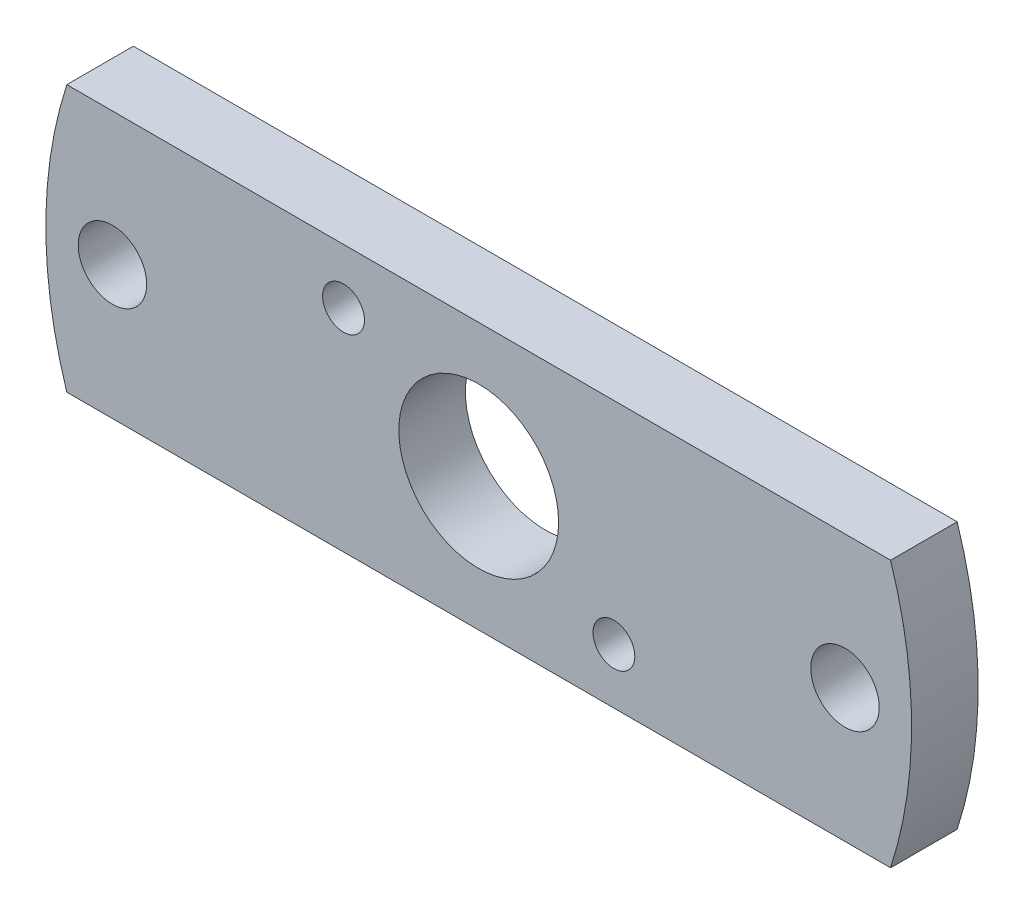
ISO-10303-21;
HEADER;
FILE_DESCRIPTION(('STEP AP214'),'2;1');
FILE_NAME('part.step','',(''),(''),'','','');
FILE_SCHEMA(('AUTOMOTIVE_DESIGN { 1 0 10303 214 1 1 1 1 }'));
ENDSEC;
DATA;
#1=APPLICATION_CONTEXT('core data for automotive mechanical design processes');
#2=APPLICATION_PROTOCOL_DEFINITION('international standard','automotive_design',2000,#1);
#3=PRODUCT_CONTEXT('',#1,'mechanical');
#4=PRODUCT('Part','Part','',(#3));
#5=PRODUCT_RELATED_PRODUCT_CATEGORY('part','',(#4));
#6=PRODUCT_DEFINITION_FORMATION('','',#4);
#7=PRODUCT_DEFINITION_CONTEXT('part definition',#1,'design');
#8=PRODUCT_DEFINITION('design','',#6,#7);
#9=PRODUCT_DEFINITION_SHAPE('','',#8);
#10=(LENGTH_UNIT() NAMED_UNIT(*) SI_UNIT(.MILLI.,.METRE.));
#11=(NAMED_UNIT(*) PLANE_ANGLE_UNIT() SI_UNIT($,.RADIAN.));
#12=(NAMED_UNIT(*) SI_UNIT($,.STERADIAN.) SOLID_ANGLE_UNIT());
#13=UNCERTAINTY_MEASURE_WITH_UNIT(LENGTH_MEASURE(1.E-05),#10,'distance_accuracy_value','');
#14=(GEOMETRIC_REPRESENTATION_CONTEXT(3) GLOBAL_UNCERTAINTY_ASSIGNED_CONTEXT((#13)) GLOBAL_UNIT_ASSIGNED_CONTEXT((#10,
#11,#12)) REPRESENTATION_CONTEXT('',''));
#15=CARTESIAN_POINT('',(0.,0.,0.));
#16=DIRECTION('',(0.,0.,1.));
#17=DIRECTION('',(1.,0.,0.));
#18=AXIS2_PLACEMENT_3D('',#15,#16,#17);
#19=CARTESIAN_POINT('',(0.,0.,3.175));
#20=DIRECTION('',(0.,0.,1.));
#21=DIRECTION('',(1.,0.,0.));
#22=AXIS2_PLACEMENT_3D('',#19,#20,#21);
#23=PLANE('',#22);
#24=CARTESIAN_POINT('',(-6.44513426004359,3.72110000000166,3.175));
#25=DIRECTION('',(0.,0.,1.));
#26=DIRECTION('',(1.,0.,0.));
#27=AXIS2_PLACEMENT_3D('',#24,#25,#26);
#28=CIRCLE('',#27,0.996949999999999);
#29=CARTESIAN_POINT('',(-5.44818426004359,3.72110000000166,3.175));
#30=VERTEX_POINT('',#29);
#31=EDGE_CURVE('E142',#30,#30,#28,.T.);
#32=ORIENTED_EDGE('',*,*,#31,.F.);
#33=EDGE_LOOP('',(#32));
#34=FACE_BOUND('',#33,.T.);
#35=CARTESIAN_POINT('',(6.44513426004548,-3.72109999999839,3.175));
#36=DIRECTION('',(0.,0.,1.));
#37=DIRECTION('',(1.,0.,0.));
#38=AXIS2_PLACEMENT_3D('',#35,#36,#37);
#39=CIRCLE('',#38,0.996949999999999);
#40=CARTESIAN_POINT('',(7.44208426004548,-3.72109999999839,3.175));
#41=VERTEX_POINT('',#40);
#42=EDGE_CURVE('E136',#41,#41,#39,.T.);
#43=ORIENTED_EDGE('',*,*,#42,.F.);
#44=EDGE_LOOP('',(#43));
#45=FACE_BOUND('',#44,.T.);
#46=CARTESIAN_POINT('',(-17.4625,0.,3.175));
#47=DIRECTION('',(0.,0.,1.));
#48=DIRECTION('',(1.,0.,0.));
#49=AXIS2_PLACEMENT_3D('',#46,#47,#48);
#50=CIRCLE('',#49,1.63195);
#51=CARTESIAN_POINT('',(-15.83055,0.,3.175));
#52=VERTEX_POINT('',#51);
#53=EDGE_CURVE('E130',#52,#52,#50,.T.);
#54=ORIENTED_EDGE('',*,*,#53,.F.);
#55=EDGE_LOOP('',(#54));
#56=FACE_BOUND('',#55,.T.);
#57=CARTESIAN_POINT('',(17.4625,0.,3.175));
#58=DIRECTION('',(0.,0.,1.));
#59=DIRECTION('',(1.,0.,0.));
#60=AXIS2_PLACEMENT_3D('',#57,#58,#59);
#61=CIRCLE('',#60,1.63195);
#62=CARTESIAN_POINT('',(19.09445,0.,3.175));
#63=VERTEX_POINT('',#62);
#64=EDGE_CURVE('E124',#63,#63,#61,.T.);
#65=ORIENTED_EDGE('',*,*,#64,.F.);
#66=EDGE_LOOP('',(#65));
#67=FACE_BOUND('',#66,.T.);
#68=CARTESIAN_POINT('',(0.,0.,3.175));
#69=DIRECTION('',(0.,0.,1.));
#70=DIRECTION('',(1.,0.,0.));
#71=AXIS2_PLACEMENT_3D('',#68,#69,#70);
#72=CIRCLE('',#71,20.6375);
#73=CARTESIAN_POINT('',(-19.6362905420041,6.35,3.175));
#74=VERTEX_POINT('',#73);
#75=CARTESIAN_POINT('',(-19.6362905420041,-6.35,3.175));
#76=VERTEX_POINT('',#75);
#77=EDGE_CURVE('E89',#74,#76,#72,.T.);
#78=ORIENTED_EDGE('',*,*,#77,.T.);
#79=DIRECTION('',(1.,0.,0.));
#80=VECTOR('',#79,1.);
#81=CARTESIAN_POINT('',(19.6362905420041,-6.35,3.175));
#82=LINE('',#81,#80);
#83=CARTESIAN_POINT('',(19.6362905420041,-6.35000000000002,3.175));
#84=VERTEX_POINT('',#83);
#85=EDGE_CURVE('E84',#76,#84,#82,.T.);
#86=ORIENTED_EDGE('',*,*,#85,.T.);
#87=CARTESIAN_POINT('',(0.,0.,3.175));
#88=DIRECTION('',(0.,0.,1.));
#89=DIRECTION('',(1.,0.,0.));
#90=AXIS2_PLACEMENT_3D('',#87,#88,#89);
#91=CIRCLE('',#90,20.6375);
#92=CARTESIAN_POINT('',(19.6362905420041,6.35,3.175));
#93=VERTEX_POINT('',#92);
#94=EDGE_CURVE('E87',#84,#93,#91,.T.);
#95=ORIENTED_EDGE('',*,*,#94,.T.);
#96=DIRECTION('',(-1.,0.,0.));
#97=VECTOR('',#96,1.);
#98=CARTESIAN_POINT('',(-19.6362905420041,6.35,3.175));
#99=LINE('',#98,#97);
#100=EDGE_CURVE('E54',#93,#74,#99,.T.);
#101=ORIENTED_EDGE('',*,*,#100,.T.);
#102=EDGE_LOOP('',(#78,#86,#95,#101));
#103=FACE_BOUND('',#102,.T.);
#104=CARTESIAN_POINT('',(0.,0.,3.175));
#105=DIRECTION('',(0.,0.,1.));
#106=DIRECTION('',(1.,0.,0.));
#107=AXIS2_PLACEMENT_3D('',#104,#105,#106);
#108=CIRCLE('',#107,3.81);
#109=CARTESIAN_POINT('',(3.81,0.,3.175));
#110=VERTEX_POINT('',#109);
#111=EDGE_CURVE('E104',#110,#110,#108,.T.);
#112=ORIENTED_EDGE('',*,*,#111,.F.);
#113=EDGE_LOOP('',(#112));
#114=FACE_BOUND('',#113,.T.);
#115=ADVANCED_FACE('F37',(#34,#45,#56,#67,#103,#114),#23,.T.);
#116=CARTESIAN_POINT('',(0.,0.,0.));
#117=DIRECTION('',(0.,0.,1.));
#118=DIRECTION('',(1.,0.,0.));
#119=AXIS2_PLACEMENT_3D('',#116,#117,#118);
#120=PLANE('',#119);
#121=CARTESIAN_POINT('',(-6.44513426004359,3.72110000000166,0.));
#122=DIRECTION('',(0.,0.,1.));
#123=DIRECTION('',(1.,0.,0.));
#124=AXIS2_PLACEMENT_3D('',#121,#122,#123);
#125=CIRCLE('',#124,0.996949999999999);
#126=CARTESIAN_POINT('',(-5.44818426004359,3.72110000000166,0.));
#127=VERTEX_POINT('',#126);
#128=EDGE_CURVE('E139',#127,#127,#125,.T.);
#129=ORIENTED_EDGE('',*,*,#128,.T.);
#130=EDGE_LOOP('',(#129));
#131=FACE_BOUND('',#130,.T.);
#132=CARTESIAN_POINT('',(6.44513426004548,-3.72109999999839,0.));
#133=DIRECTION('',(0.,0.,1.));
#134=DIRECTION('',(1.,0.,0.));
#135=AXIS2_PLACEMENT_3D('',#132,#133,#134);
#136=CIRCLE('',#135,0.996949999999999);
#137=CARTESIAN_POINT('',(7.44208426004548,-3.72109999999839,0.));
#138=VERTEX_POINT('',#137);
#139=EDGE_CURVE('E133',#138,#138,#136,.T.);
#140=ORIENTED_EDGE('',*,*,#139,.T.);
#141=EDGE_LOOP('',(#140));
#142=FACE_BOUND('',#141,.T.);
#143=CARTESIAN_POINT('',(-17.4625,0.,0.));
#144=DIRECTION('',(0.,0.,1.));
#145=DIRECTION('',(1.,0.,0.));
#146=AXIS2_PLACEMENT_3D('',#143,#144,#145);
#147=CIRCLE('',#146,1.63195);
#148=CARTESIAN_POINT('',(-15.83055,0.,0.));
#149=VERTEX_POINT('',#148);
#150=EDGE_CURVE('E127',#149,#149,#147,.T.);
#151=ORIENTED_EDGE('',*,*,#150,.T.);
#152=EDGE_LOOP('',(#151));
#153=FACE_BOUND('',#152,.T.);
#154=CARTESIAN_POINT('',(17.4625,0.,0.));
#155=DIRECTION('',(0.,0.,1.));
#156=DIRECTION('',(1.,0.,0.));
#157=AXIS2_PLACEMENT_3D('',#154,#155,#156);
#158=CIRCLE('',#157,1.63195);
#159=CARTESIAN_POINT('',(19.09445,0.,0.));
#160=VERTEX_POINT('',#159);
#161=EDGE_CURVE('E119',#160,#160,#158,.T.);
#162=ORIENTED_EDGE('',*,*,#161,.T.);
#163=EDGE_LOOP('',(#162));
#164=FACE_BOUND('',#163,.T.);
#165=CARTESIAN_POINT('',(0.,0.,0.));
#166=DIRECTION('',(0.,0.,1.));
#167=DIRECTION('',(1.,0.,0.));
#168=AXIS2_PLACEMENT_3D('',#165,#166,#167);
#169=CIRCLE('',#168,20.6375);
#170=CARTESIAN_POINT('',(-19.6362905420041,6.35,0.));
#171=VERTEX_POINT('',#170);
#172=CARTESIAN_POINT('',(-19.6362905420041,-6.35,0.));
#173=VERTEX_POINT('',#172);
#174=EDGE_CURVE('E101',#171,#173,#169,.T.);
#175=ORIENTED_EDGE('',*,*,#174,.F.);
#176=DIRECTION('',(-1.,0.,0.));
#177=VECTOR('',#176,1.);
#178=CARTESIAN_POINT('',(-19.6362905420041,6.35,0.));
#179=LINE('',#178,#177);
#180=CARTESIAN_POINT('',(19.6362905420041,6.35,0.));
#181=VERTEX_POINT('',#180);
#182=EDGE_CURVE('E77',#181,#171,#179,.T.);
#183=ORIENTED_EDGE('',*,*,#182,.F.);
#184=CARTESIAN_POINT('',(0.,0.,0.));
#185=DIRECTION('',(0.,0.,1.));
#186=DIRECTION('',(1.,0.,0.));
#187=AXIS2_PLACEMENT_3D('',#184,#185,#186);
#188=CIRCLE('',#187,20.6375);
#189=CARTESIAN_POINT('',(19.6362905420041,-6.35000000000002,0.));
#190=VERTEX_POINT('',#189);
#191=EDGE_CURVE('E71',#190,#181,#188,.T.);
#192=ORIENTED_EDGE('',*,*,#191,.F.);
#193=DIRECTION('',(1.,0.,0.));
#194=VECTOR('',#193,1.);
#195=CARTESIAN_POINT('',(19.6362905420041,-6.35,0.));
#196=LINE('',#195,#194);
#197=EDGE_CURVE('E93',#173,#190,#196,.T.);
#198=ORIENTED_EDGE('',*,*,#197,.F.);
#199=EDGE_LOOP('',(#175,#183,#192,#198));
#200=FACE_BOUND('',#199,.T.);
#201=CARTESIAN_POINT('',(0.,0.,0.));
#202=DIRECTION('',(0.,0.,1.));
#203=DIRECTION('',(1.,0.,0.));
#204=AXIS2_PLACEMENT_3D('',#201,#202,#203);
#205=CIRCLE('',#204,3.81);
#206=CARTESIAN_POINT('',(3.81,0.,0.));
#207=VERTEX_POINT('',#206);
#208=EDGE_CURVE('E116',#207,#207,#205,.T.);
#209=ORIENTED_EDGE('',*,*,#208,.T.);
#210=EDGE_LOOP('',(#209));
#211=FACE_BOUND('',#210,.T.);
#212=ADVANCED_FACE('F112',(#131,#142,#153,#164,#200,#211),#120,.F.);
#213=CARTESIAN_POINT('',(0.,0.,3.175));
#214=DIRECTION('',(0.,0.,-1.));
#215=DIRECTION('',(-1.,0.,0.));
#216=AXIS2_PLACEMENT_3D('',#213,#214,#215);
#217=CYLINDRICAL_SURFACE('',#216,20.6375);
#218=ORIENTED_EDGE('',*,*,#174,.T.);
#219=DIRECTION('',(0.,0.,-1.));
#220=VECTOR('',#219,1.);
#221=CARTESIAN_POINT('',(-19.6362905420041,-6.35,3.175));
#222=LINE('',#221,#220);
#223=EDGE_CURVE('E11',#76,#173,#222,.T.);
#224=ORIENTED_EDGE('',*,*,#223,.F.);
#225=ORIENTED_EDGE('',*,*,#77,.F.);
#226=DIRECTION('',(0.,0.,-1.));
#227=VECTOR('',#226,1.);
#228=CARTESIAN_POINT('',(-19.6362905420041,6.35,3.175));
#229=LINE('',#228,#227);
#230=EDGE_CURVE('E97',#74,#171,#229,.T.);
#231=ORIENTED_EDGE('',*,*,#230,.T.);
#232=EDGE_LOOP('',(#218,#224,#225,#231));
#233=FACE_BOUND('',#232,.T.);
#234=ADVANCED_FACE('F39',(#233),#217,.T.);
#235=CARTESIAN_POINT('',(19.6362905420041,-6.35,3.175));
#236=DIRECTION('',(0.,1.,0.));
#237=DIRECTION('',(0.,0.,1.));
#238=AXIS2_PLACEMENT_3D('',#235,#236,#237);
#239=PLANE('',#238);
#240=ORIENTED_EDGE('',*,*,#197,.T.);
#241=DIRECTION('',(0.,0.,-1.));
#242=VECTOR('',#241,1.);
#243=CARTESIAN_POINT('',(19.6362905420041,-6.35000000000002,3.175));
#244=LINE('',#243,#242);
#245=EDGE_CURVE('E46',#84,#190,#244,.T.);
#246=ORIENTED_EDGE('',*,*,#245,.F.);
#247=ORIENTED_EDGE('',*,*,#85,.F.);
#248=ORIENTED_EDGE('',*,*,#223,.T.);
#249=EDGE_LOOP('',(#240,#246,#247,#248));
#250=FACE_BOUND('',#249,.T.);
#251=ADVANCED_FACE('F92',(#250),#239,.F.);
#252=CARTESIAN_POINT('',(0.,0.,3.175));
#253=DIRECTION('',(0.,0.,-1.));
#254=DIRECTION('',(-1.,0.,0.));
#255=AXIS2_PLACEMENT_3D('',#252,#253,#254);
#256=CYLINDRICAL_SURFACE('',#255,20.6375);
#257=ORIENTED_EDGE('',*,*,#191,.T.);
#258=DIRECTION('',(0.,0.,-1.));
#259=VECTOR('',#258,1.);
#260=CARTESIAN_POINT('',(19.6362905420041,6.35,3.175));
#261=LINE('',#260,#259);
#262=EDGE_CURVE('E94',#93,#181,#261,.T.);
#263=ORIENTED_EDGE('',*,*,#262,.F.);
#264=ORIENTED_EDGE('',*,*,#94,.F.);
#265=ORIENTED_EDGE('',*,*,#245,.T.);
#266=EDGE_LOOP('',(#257,#263,#264,#265));
#267=FACE_BOUND('',#266,.T.);
#268=ADVANCED_FACE('F95',(#267),#256,.T.);
#269=CARTESIAN_POINT('',(-19.6362905420041,6.35,3.175));
#270=DIRECTION('',(0.,-1.,0.));
#271=DIRECTION('',(0.,0.,-1.));
#272=AXIS2_PLACEMENT_3D('',#269,#270,#271);
#273=PLANE('',#272);
#274=ORIENTED_EDGE('',*,*,#182,.T.);
#275=ORIENTED_EDGE('',*,*,#230,.F.);
#276=ORIENTED_EDGE('',*,*,#100,.F.);
#277=ORIENTED_EDGE('',*,*,#262,.T.);
#278=EDGE_LOOP('',(#274,#275,#276,#277));
#279=FACE_BOUND('',#278,.T.);
#280=ADVANCED_FACE('F109',(#279),#273,.F.);
#281=CARTESIAN_POINT('',(0.,0.,3.175));
#282=DIRECTION('',(0.,0.,-1.));
#283=DIRECTION('',(-1.,0.,0.));
#284=AXIS2_PLACEMENT_3D('',#281,#282,#283);
#285=CYLINDRICAL_SURFACE('',#284,3.81);
#286=ORIENTED_EDGE('',*,*,#111,.T.);
#287=EDGE_LOOP('',(#286));
#288=FACE_BOUND('',#287,.T.);
#289=ORIENTED_EDGE('',*,*,#208,.F.);
#290=EDGE_LOOP('',(#289));
#291=FACE_BOUND('',#290,.T.);
#292=ADVANCED_FACE('F160',(#288,#291),#285,.F.);
#293=CARTESIAN_POINT('',(17.4625,0.,3.175));
#294=DIRECTION('',(0.,0.,1.));
#295=DIRECTION('',(1.,0.,0.));
#296=AXIS2_PLACEMENT_3D('',#293,#294,#295);
#297=CYLINDRICAL_SURFACE('',#296,1.63195);
#298=ORIENTED_EDGE('',*,*,#161,.F.);
#299=EDGE_LOOP('',(#298));
#300=FACE_BOUND('',#299,.T.);
#301=ORIENTED_EDGE('',*,*,#64,.T.);
#302=EDGE_LOOP('',(#301));
#303=FACE_BOUND('',#302,.T.);
#304=ADVANCED_FACE('F157',(#300,#303),#297,.F.);
#305=CARTESIAN_POINT('',(-17.4625,0.,3.175));
#306=DIRECTION('',(0.,0.,1.));
#307=DIRECTION('',(1.,0.,0.));
#308=AXIS2_PLACEMENT_3D('',#305,#306,#307);
#309=CYLINDRICAL_SURFACE('',#308,1.63195);
#310=ORIENTED_EDGE('',*,*,#150,.F.);
#311=EDGE_LOOP('',(#310));
#312=FACE_BOUND('',#311,.T.);
#313=ORIENTED_EDGE('',*,*,#53,.T.);
#314=EDGE_LOOP('',(#313));
#315=FACE_BOUND('',#314,.T.);
#316=ADVANCED_FACE('F159',(#312,#315),#309,.F.);
#317=CARTESIAN_POINT('',(6.44513426004548,-3.72109999999839,3.175));
#318=DIRECTION('',(0.,0.,1.));
#319=DIRECTION('',(1.,0.,0.));
#320=AXIS2_PLACEMENT_3D('',#317,#318,#319);
#321=CYLINDRICAL_SURFACE('',#320,0.996949999999999);
#322=ORIENTED_EDGE('',*,*,#139,.F.);
#323=EDGE_LOOP('',(#322));
#324=FACE_BOUND('',#323,.T.);
#325=ORIENTED_EDGE('',*,*,#42,.T.);
#326=EDGE_LOOP('',(#325));
#327=FACE_BOUND('',#326,.T.);
#328=ADVANCED_FACE('F167',(#324,#327),#321,.F.);
#329=CARTESIAN_POINT('',(-6.44513426004359,3.72110000000166,3.175));
#330=DIRECTION('',(0.,0.,1.));
#331=DIRECTION('',(1.,0.,0.));
#332=AXIS2_PLACEMENT_3D('',#329,#330,#331);
#333=CYLINDRICAL_SURFACE('',#332,0.996949999999999);
#334=ORIENTED_EDGE('',*,*,#128,.F.);
#335=EDGE_LOOP('',(#334));
#336=FACE_BOUND('',#335,.T.);
#337=ORIENTED_EDGE('',*,*,#31,.T.);
#338=EDGE_LOOP('',(#337));
#339=FACE_BOUND('',#338,.T.);
#340=ADVANCED_FACE('F146',(#336,#339),#333,.F.);
#341=CLOSED_SHELL('',(#115,#212,#234,#251,#268,#280,#292,#304,#316,#328,#340));
#342=MANIFOLD_SOLID_BREP('B2',#341);
#343=ADVANCED_BREP_SHAPE_REPRESENTATION('',(#18,#342),#14);
#344=SHAPE_DEFINITION_REPRESENTATION(#9,#343);
ENDSEC;
END-ISO-10303-21;
